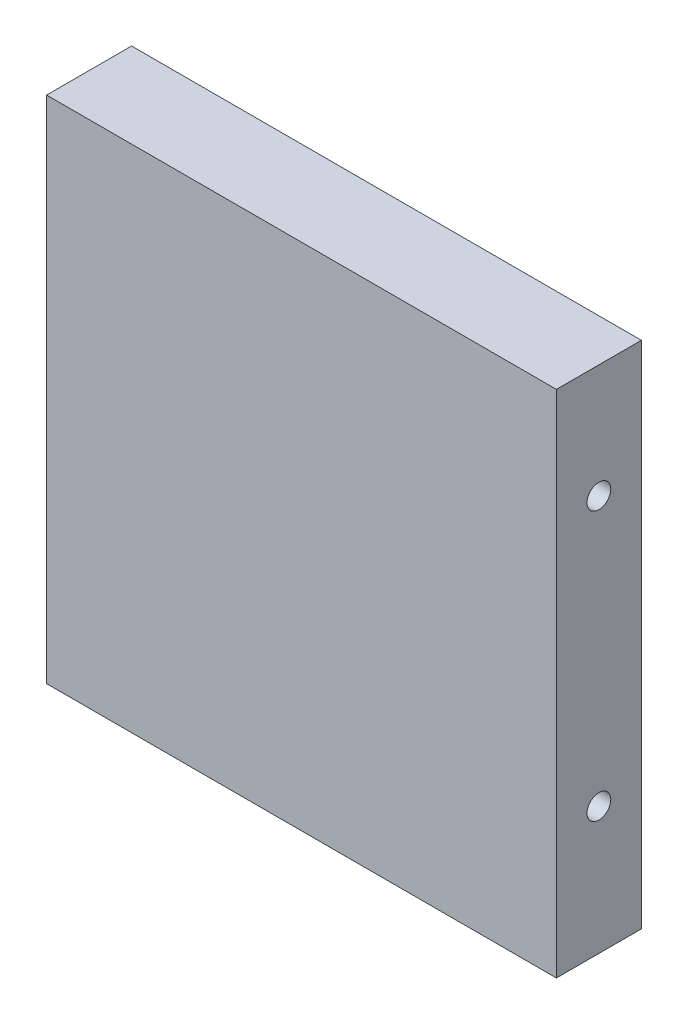
ISO-10303-21;
HEADER;
FILE_DESCRIPTION(('STEP AP214'),'2;1');
FILE_NAME('part.step','',(''),(''),'','','');
FILE_SCHEMA(('AUTOMOTIVE_DESIGN { 1 0 10303 214 1 1 1 1 }'));
ENDSEC;
DATA;
#1=APPLICATION_CONTEXT('core data for automotive mechanical design processes');
#2=APPLICATION_PROTOCOL_DEFINITION('international standard','automotive_design',2000,#1);
#3=PRODUCT_CONTEXT('',#1,'mechanical');
#4=PRODUCT('Part','Part','',(#3));
#5=PRODUCT_RELATED_PRODUCT_CATEGORY('part','',(#4));
#6=PRODUCT_DEFINITION_FORMATION('','',#4);
#7=PRODUCT_DEFINITION_CONTEXT('part definition',#1,'design');
#8=PRODUCT_DEFINITION('design','',#6,#7);
#9=PRODUCT_DEFINITION_SHAPE('','',#8);
#10=(LENGTH_UNIT() NAMED_UNIT(*) SI_UNIT(.MILLI.,.METRE.));
#11=(NAMED_UNIT(*) PLANE_ANGLE_UNIT() SI_UNIT($,.RADIAN.));
#12=(NAMED_UNIT(*) SI_UNIT($,.STERADIAN.) SOLID_ANGLE_UNIT());
#13=UNCERTAINTY_MEASURE_WITH_UNIT(LENGTH_MEASURE(1.E-05),#10,'distance_accuracy_value','');
#14=(GEOMETRIC_REPRESENTATION_CONTEXT(3) GLOBAL_UNCERTAINTY_ASSIGNED_CONTEXT((#13)) GLOBAL_UNIT_ASSIGNED_CONTEXT((#10,
#11,#12)) REPRESENTATION_CONTEXT('',''));
#15=CARTESIAN_POINT('',(0.,0.,0.));
#16=DIRECTION('',(0.,0.,1.));
#17=DIRECTION('',(1.,0.,0.));
#18=AXIS2_PLACEMENT_3D('',#15,#16,#17);
#19=CARTESIAN_POINT('',(19.05,-19.05,6.35));
#20=DIRECTION('',(-1.,0.,0.));
#21=DIRECTION('',(0.,0.,1.));
#22=AXIS2_PLACEMENT_3D('',#19,#20,#21);
#23=PLANE('',#22);
#24=CARTESIAN_POINT('',(19.05,10.5664,3.17500000000001));
#25=DIRECTION('',(1.,0.,0.));
#26=DIRECTION('',(0.,0.,-1.));
#27=AXIS2_PLACEMENT_3D('',#24,#25,#26);
#28=CIRCLE('',#27,0.888999999999989);
#29=CARTESIAN_POINT('',(19.05,10.5664,2.28600000000002));
#30=VERTEX_POINT('',#29);
#31=EDGE_CURVE('E104',#30,#30,#28,.T.);
#32=ORIENTED_EDGE('',*,*,#31,.F.);
#33=EDGE_LOOP('',(#32));
#34=FACE_BOUND('',#33,.T.);
#35=CARTESIAN_POINT('',(19.05,-9.525,3.17500000000001));
#36=DIRECTION('',(1.,0.,0.));
#37=DIRECTION('',(0.,0.,-1.));
#38=AXIS2_PLACEMENT_3D('',#35,#36,#37);
#39=CIRCLE('',#38,0.888999999999989);
#40=CARTESIAN_POINT('',(19.05,-9.525,2.28600000000002));
#41=VERTEX_POINT('',#40);
#42=EDGE_CURVE('E103',#41,#41,#39,.T.);
#43=ORIENTED_EDGE('',*,*,#42,.F.);
#44=EDGE_LOOP('',(#43));
#45=FACE_BOUND('',#44,.T.);
#46=DIRECTION('',(0.,1.,0.));
#47=VECTOR('',#46,1.);
#48=CARTESIAN_POINT('',(19.05,-19.05,0.));
#49=LINE('',#48,#47);
#50=CARTESIAN_POINT('',(19.05,-19.05,0.));
#51=VERTEX_POINT('',#50);
#52=CARTESIAN_POINT('',(19.05,19.05,0.));
#53=VERTEX_POINT('',#52);
#54=EDGE_CURVE('E126',#51,#53,#49,.T.);
#55=ORIENTED_EDGE('',*,*,#54,.T.);
#56=DIRECTION('',(0.,0.,-1.));
#57=VECTOR('',#56,1.);
#58=CARTESIAN_POINT('',(19.05,19.05,6.35));
#59=LINE('',#58,#57);
#60=CARTESIAN_POINT('',(19.05,19.05,6.35));
#61=VERTEX_POINT('',#60);
#62=EDGE_CURVE('E11',#61,#53,#59,.T.);
#63=ORIENTED_EDGE('',*,*,#62,.F.);
#64=DIRECTION('',(0.,1.,0.));
#65=VECTOR('',#64,1.);
#66=CARTESIAN_POINT('',(19.05,-19.05,6.35));
#67=LINE('',#66,#65);
#68=CARTESIAN_POINT('',(19.05,-19.05,6.35));
#69=VERTEX_POINT('',#68);
#70=EDGE_CURVE('E127',#69,#61,#67,.T.);
#71=ORIENTED_EDGE('',*,*,#70,.F.);
#72=DIRECTION('',(0.,0.,-1.));
#73=VECTOR('',#72,1.);
#74=CARTESIAN_POINT('',(19.05,-19.05,6.35));
#75=LINE('',#74,#73);
#76=EDGE_CURVE('E133',#69,#51,#75,.T.);
#77=ORIENTED_EDGE('',*,*,#76,.T.);
#78=EDGE_LOOP('',(#55,#63,#71,#77));
#79=FACE_BOUND('',#78,.T.);
#80=ADVANCED_FACE('F33',(#34,#45,#79),#23,.F.);
#81=CARTESIAN_POINT('',(-19.05,19.05,6.35));
#82=DIRECTION('',(0.,-1.,0.));
#83=DIRECTION('',(0.,0.,-1.));
#84=AXIS2_PLACEMENT_3D('',#81,#82,#83);
#85=PLANE('',#84);
#86=DIRECTION('',(-1.,0.,0.));
#87=VECTOR('',#86,1.);
#88=CARTESIAN_POINT('',(-19.05,19.05,0.));
#89=LINE('',#88,#87);
#90=CARTESIAN_POINT('',(-19.05,19.05,0.));
#91=VERTEX_POINT('',#90);
#92=EDGE_CURVE('E136',#53,#91,#89,.T.);
#93=ORIENTED_EDGE('',*,*,#92,.T.);
#94=DIRECTION('',(0.,0.,-1.));
#95=VECTOR('',#94,1.);
#96=CARTESIAN_POINT('',(-19.05,19.05,6.35));
#97=LINE('',#96,#95);
#98=CARTESIAN_POINT('',(-19.05,19.05,6.35));
#99=VERTEX_POINT('',#98);
#100=EDGE_CURVE('E41',#99,#91,#97,.T.);
#101=ORIENTED_EDGE('',*,*,#100,.F.);
#102=DIRECTION('',(-1.,0.,0.));
#103=VECTOR('',#102,1.);
#104=CARTESIAN_POINT('',(-19.05,19.05,6.35));
#105=LINE('',#104,#103);
#106=EDGE_CURVE('E80',#61,#99,#105,.T.);
#107=ORIENTED_EDGE('',*,*,#106,.F.);
#108=ORIENTED_EDGE('',*,*,#62,.T.);
#109=EDGE_LOOP('',(#93,#101,#107,#108));
#110=FACE_BOUND('',#109,.T.);
#111=ADVANCED_FACE('F160',(#110),#85,.F.);
#112=CARTESIAN_POINT('',(-19.05,-19.05,6.35));
#113=DIRECTION('',(1.,0.,0.));
#114=DIRECTION('',(0.,0.,-1.));
#115=AXIS2_PLACEMENT_3D('',#112,#113,#114);
#116=PLANE('',#115);
#117=DIRECTION('',(0.,-1.,0.));
#118=VECTOR('',#117,1.);
#119=CARTESIAN_POINT('',(-19.05,-19.05,0.));
#120=LINE('',#119,#118);
#121=CARTESIAN_POINT('',(-19.05,-19.05,0.));
#122=VERTEX_POINT('',#121);
#123=EDGE_CURVE('E67',#91,#122,#120,.T.);
#124=ORIENTED_EDGE('',*,*,#123,.T.);
#125=DIRECTION('',(0.,0.,-1.));
#126=VECTOR('',#125,1.);
#127=CARTESIAN_POINT('',(-19.05,-19.05,6.35));
#128=LINE('',#127,#126);
#129=CARTESIAN_POINT('',(-19.05,-19.05,6.35));
#130=VERTEX_POINT('',#129);
#131=EDGE_CURVE('E141',#130,#122,#128,.T.);
#132=ORIENTED_EDGE('',*,*,#131,.F.);
#133=DIRECTION('',(0.,-1.,0.));
#134=VECTOR('',#133,1.);
#135=CARTESIAN_POINT('',(-19.05,-19.05,6.35));
#136=LINE('',#135,#134);
#137=EDGE_CURVE('E130',#99,#130,#136,.T.);
#138=ORIENTED_EDGE('',*,*,#137,.F.);
#139=ORIENTED_EDGE('',*,*,#100,.T.);
#140=EDGE_LOOP('',(#124,#132,#138,#139));
#141=FACE_BOUND('',#140,.T.);
#142=ADVANCED_FACE('F143',(#141),#116,.F.);
#143=CARTESIAN_POINT('',(-19.05,-19.05,6.35));
#144=DIRECTION('',(0.,1.,0.));
#145=DIRECTION('',(0.,0.,1.));
#146=AXIS2_PLACEMENT_3D('',#143,#144,#145);
#147=PLANE('',#146);
#148=CARTESIAN_POINT('',(15.24,-19.05,2.60289999999997));
#149=DIRECTION('',(0.,-1.,0.));
#150=DIRECTION('',(0.,0.,-1.));
#151=AXIS2_PLACEMENT_3D('',#148,#149,#150);
#152=CIRCLE('',#151,0.888999999999999);
#153=CARTESIAN_POINT('',(15.24,-19.05,1.71389999999997));
#154=VERTEX_POINT('',#153);
#155=EDGE_CURVE('E114',#154,#154,#152,.T.);
#156=ORIENTED_EDGE('',*,*,#155,.F.);
#157=EDGE_LOOP('',(#156));
#158=FACE_BOUND('',#157,.T.);
#159=CARTESIAN_POINT('',(-15.24,-19.05,2.6029));
#160=DIRECTION('',(0.,-1.,0.));
#161=DIRECTION('',(0.,0.,-1.));
#162=AXIS2_PLACEMENT_3D('',#159,#160,#161);
#163=CIRCLE('',#162,0.888999999999999);
#164=CARTESIAN_POINT('',(-15.24,-19.05,1.7139));
#165=VERTEX_POINT('',#164);
#166=EDGE_CURVE('E120',#165,#165,#163,.T.);
#167=ORIENTED_EDGE('',*,*,#166,.F.);
#168=EDGE_LOOP('',(#167));
#169=FACE_BOUND('',#168,.T.);
#170=DIRECTION('',(1.,0.,0.));
#171=VECTOR('',#170,1.);
#172=CARTESIAN_POINT('',(-19.05,-19.05,0.));
#173=LINE('',#172,#171);
#174=EDGE_CURVE('E73',#122,#51,#173,.T.);
#175=ORIENTED_EDGE('',*,*,#174,.T.);
#176=ORIENTED_EDGE('',*,*,#76,.F.);
#177=DIRECTION('',(1.,0.,0.));
#178=VECTOR('',#177,1.);
#179=CARTESIAN_POINT('',(-19.05,-19.05,6.35));
#180=LINE('',#179,#178);
#181=EDGE_CURVE('E49',#130,#69,#180,.T.);
#182=ORIENTED_EDGE('',*,*,#181,.F.);
#183=ORIENTED_EDGE('',*,*,#131,.T.);
#184=EDGE_LOOP('',(#175,#176,#182,#183));
#185=FACE_BOUND('',#184,.T.);
#186=ADVANCED_FACE('F150',(#158,#169,#185),#147,.F.);
#187=CARTESIAN_POINT('',(0.,0.,6.35));
#188=DIRECTION('',(0.,0.,-1.));
#189=DIRECTION('',(-1.,0.,0.));
#190=AXIS2_PLACEMENT_3D('',#187,#188,#189);
#191=PLANE('',#190);
#192=ORIENTED_EDGE('',*,*,#70,.T.);
#193=ORIENTED_EDGE('',*,*,#106,.T.);
#194=ORIENTED_EDGE('',*,*,#137,.T.);
#195=ORIENTED_EDGE('',*,*,#181,.T.);
#196=EDGE_LOOP('',(#192,#193,#194,#195));
#197=FACE_BOUND('',#196,.T.);
#198=ADVANCED_FACE('F152',(#197),#191,.F.);
#199=CARTESIAN_POINT('',(0.,0.,0.));
#200=DIRECTION('',(0.,0.,-1.));
#201=DIRECTION('',(-1.,0.,0.));
#202=AXIS2_PLACEMENT_3D('',#199,#200,#201);
#203=PLANE('',#202);
#204=ORIENTED_EDGE('',*,*,#54,.F.);
#205=ORIENTED_EDGE('',*,*,#174,.F.);
#206=ORIENTED_EDGE('',*,*,#123,.F.);
#207=ORIENTED_EDGE('',*,*,#92,.F.);
#208=EDGE_LOOP('',(#204,#205,#206,#207));
#209=FACE_BOUND('',#208,.T.);
#210=ADVANCED_FACE('F146',(#209),#203,.T.);
#211=CARTESIAN_POINT('',(-15.24,-11.43,2.6029));
#212=DIRECTION('',(0.,-1.,0.));
#213=DIRECTION('',(0.,0.,-1.));
#214=AXIS2_PLACEMENT_3D('',#211,#212,#213);
#215=CONICAL_SURFACE('',#214,0.888999999999997,1.02974425867665);
#216=CARTESIAN_POINT('',(-15.24,-10.8958349096845,2.6029));
#217=VERTEX_POINT('',#216);
#218=VERTEX_LOOP('',#217);
#219=FACE_BOUND('',#218,.T.);
#220=CARTESIAN_POINT('',(-15.24,-11.43,2.6029));
#221=DIRECTION('',(0.,-1.,0.));
#222=DIRECTION('',(0.,0.,-1.));
#223=AXIS2_PLACEMENT_3D('',#220,#221,#222);
#224=CIRCLE('',#223,0.888999999999997);
#225=CARTESIAN_POINT('',(-15.24,-11.43,1.7139));
#226=VERTEX_POINT('',#225);
#227=EDGE_CURVE('E123',#226,#226,#224,.T.);
#228=ORIENTED_EDGE('',*,*,#227,.T.);
#229=EDGE_LOOP('',(#228));
#230=FACE_BOUND('',#229,.T.);
#231=ADVANCED_FACE('F197',(#219,#230),#215,.F.);
#232=CARTESIAN_POINT('',(-15.24,-19.05,2.6029));
#233=DIRECTION('',(0.,-1.,0.));
#234=DIRECTION('',(0.,0.,-1.));
#235=AXIS2_PLACEMENT_3D('',#232,#233,#234);
#236=CYLINDRICAL_SURFACE('',#235,0.888999999999998);
#237=ORIENTED_EDGE('',*,*,#227,.F.);
#238=EDGE_LOOP('',(#237));
#239=FACE_BOUND('',#238,.T.);
#240=ORIENTED_EDGE('',*,*,#166,.T.);
#241=EDGE_LOOP('',(#240));
#242=FACE_BOUND('',#241,.T.);
#243=ADVANCED_FACE('F193',(#239,#242),#236,.F.);
#244=CARTESIAN_POINT('',(15.24,-11.43,2.60289999999997));
#245=DIRECTION('',(0.,-1.,0.));
#246=DIRECTION('',(0.,0.,-1.));
#247=AXIS2_PLACEMENT_3D('',#244,#245,#246);
#248=CONICAL_SURFACE('',#247,0.888999999999999,1.02974425867665);
#249=CARTESIAN_POINT('',(15.24,-10.8958349096845,2.60289999999997));
#250=VERTEX_POINT('',#249);
#251=VERTEX_LOOP('',#250);
#252=FACE_BOUND('',#251,.T.);
#253=CARTESIAN_POINT('',(15.24,-11.43,2.60289999999997));
#254=DIRECTION('',(0.,-1.,0.));
#255=DIRECTION('',(0.,0.,-1.));
#256=AXIS2_PLACEMENT_3D('',#253,#254,#255);
#257=CIRCLE('',#256,0.888999999999999);
#258=CARTESIAN_POINT('',(15.24,-11.43,1.71389999999997));
#259=VERTEX_POINT('',#258);
#260=EDGE_CURVE('E117',#259,#259,#257,.T.);
#261=ORIENTED_EDGE('',*,*,#260,.T.);
#262=EDGE_LOOP('',(#261));
#263=FACE_BOUND('',#262,.T.);
#264=ADVANCED_FACE('F189',(#252,#263),#248,.F.);
#265=CARTESIAN_POINT('',(15.24,-19.05,2.60289999999997));
#266=DIRECTION('',(0.,-1.,0.));
#267=DIRECTION('',(0.,0.,-1.));
#268=AXIS2_PLACEMENT_3D('',#265,#266,#267);
#269=CYLINDRICAL_SURFACE('',#268,0.888999999999999);
#270=ORIENTED_EDGE('',*,*,#260,.F.);
#271=EDGE_LOOP('',(#270));
#272=FACE_BOUND('',#271,.T.);
#273=ORIENTED_EDGE('',*,*,#155,.T.);
#274=EDGE_LOOP('',(#273));
#275=FACE_BOUND('',#274,.T.);
#276=ADVANCED_FACE('F181',(#272,#275),#269,.F.);
#277=CARTESIAN_POINT('',(11.43,-9.525,3.17500000000001));
#278=DIRECTION('',(1.,0.,0.));
#279=DIRECTION('',(0.,0.,-1.));
#280=AXIS2_PLACEMENT_3D('',#277,#278,#279);
#281=CONICAL_SURFACE('',#280,0.888999999999987,1.02974425867665);
#282=CARTESIAN_POINT('',(10.8958349096845,-9.525,3.17500000000001));
#283=VERTEX_POINT('',#282);
#284=VERTEX_LOOP('',#283);
#285=FACE_BOUND('',#284,.T.);
#286=CARTESIAN_POINT('',(11.43,-9.525,3.17500000000001));
#287=DIRECTION('',(1.,0.,0.));
#288=DIRECTION('',(0.,0.,-1.));
#289=AXIS2_PLACEMENT_3D('',#286,#287,#288);
#290=CIRCLE('',#289,0.888999999999987);
#291=CARTESIAN_POINT('',(11.43,-9.525,2.28600000000003));
#292=VERTEX_POINT('',#291);
#293=EDGE_CURVE('E107',#292,#292,#290,.T.);
#294=ORIENTED_EDGE('',*,*,#293,.T.);
#295=EDGE_LOOP('',(#294));
#296=FACE_BOUND('',#295,.T.);
#297=ADVANCED_FACE('F175',(#285,#296),#281,.F.);
#298=CARTESIAN_POINT('',(19.05,-9.525,3.17500000000001));
#299=DIRECTION('',(1.,0.,0.));
#300=DIRECTION('',(0.,0.,-1.));
#301=AXIS2_PLACEMENT_3D('',#298,#299,#300);
#302=CYLINDRICAL_SURFACE('',#301,0.888999999999988);
#303=ORIENTED_EDGE('',*,*,#293,.F.);
#304=EDGE_LOOP('',(#303));
#305=FACE_BOUND('',#304,.T.);
#306=ORIENTED_EDGE('',*,*,#42,.T.);
#307=EDGE_LOOP('',(#306));
#308=FACE_BOUND('',#307,.T.);
#309=ADVANCED_FACE('F97',(#305,#308),#302,.F.);
#310=CARTESIAN_POINT('',(11.43,10.5664,3.17500000000001));
#311=DIRECTION('',(1.,0.,0.));
#312=DIRECTION('',(0.,0.,-1.));
#313=AXIS2_PLACEMENT_3D('',#310,#311,#312);
#314=CONICAL_SURFACE('',#313,0.888999999999987,1.02974425867665);
#315=CARTESIAN_POINT('',(10.8958349096845,10.5664,3.17500000000001));
#316=VERTEX_POINT('',#315);
#317=VERTEX_LOOP('',#316);
#318=FACE_BOUND('',#317,.T.);
#319=CARTESIAN_POINT('',(11.43,10.5664,3.17500000000001));
#320=DIRECTION('',(1.,0.,0.));
#321=DIRECTION('',(0.,0.,-1.));
#322=AXIS2_PLACEMENT_3D('',#319,#320,#321);
#323=CIRCLE('',#322,0.888999999999987);
#324=CARTESIAN_POINT('',(11.43,10.5664,2.28600000000003));
#325=VERTEX_POINT('',#324);
#326=EDGE_CURVE('E101',#325,#325,#323,.T.);
#327=ORIENTED_EDGE('',*,*,#326,.T.);
#328=EDGE_LOOP('',(#327));
#329=FACE_BOUND('',#328,.T.);
#330=ADVANCED_FACE('F93',(#318,#329),#314,.F.);
#331=CARTESIAN_POINT('',(19.05,10.5664,3.17500000000001));
#332=DIRECTION('',(1.,0.,0.));
#333=DIRECTION('',(0.,0.,-1.));
#334=AXIS2_PLACEMENT_3D('',#331,#332,#333);
#335=CYLINDRICAL_SURFACE('',#334,0.888999999999988);
#336=ORIENTED_EDGE('',*,*,#326,.F.);
#337=EDGE_LOOP('',(#336));
#338=FACE_BOUND('',#337,.T.);
#339=ORIENTED_EDGE('',*,*,#31,.T.);
#340=EDGE_LOOP('',(#339));
#341=FACE_BOUND('',#340,.T.);
#342=ADVANCED_FACE('F96',(#338,#341),#335,.F.);
#343=CLOSED_SHELL('',(#80,#111,#142,#186,#198,#210,#231,#243,#264,#276,#297,#309,#330,#342));
#344=MANIFOLD_SOLID_BREP('B2',#343);
#345=ADVANCED_BREP_SHAPE_REPRESENTATION('',(#18,#344),#14);
#346=SHAPE_DEFINITION_REPRESENTATION(#9,#345);
ENDSEC;
END-ISO-10303-21;
